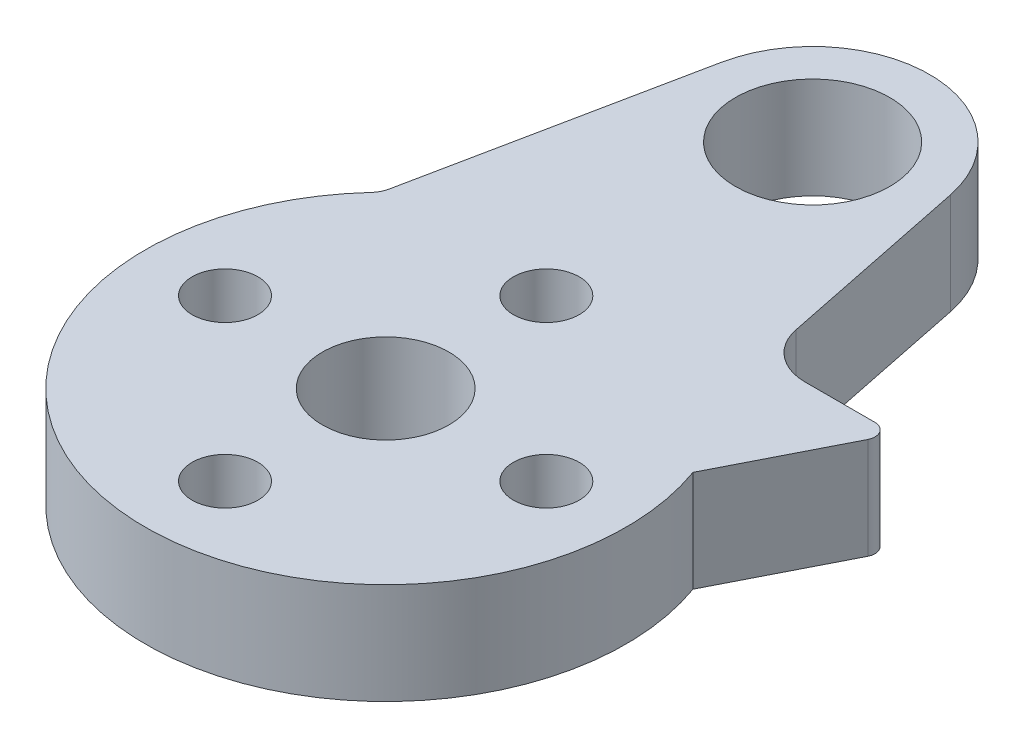
ISO-10303-21;
HEADER;
FILE_DESCRIPTION(('STEP AP214'),'2;1');
FILE_NAME('part.step','',(''),(''),'','','');
FILE_SCHEMA(('AUTOMOTIVE_DESIGN { 1 0 10303 214 1 1 1 1 }'));
ENDSEC;
DATA;
#1=APPLICATION_CONTEXT('core data for automotive mechanical design processes');
#2=APPLICATION_PROTOCOL_DEFINITION('international standard','automotive_design',2000,#1);
#3=PRODUCT_CONTEXT('',#1,'mechanical');
#4=PRODUCT('Part','Part','',(#3));
#5=PRODUCT_RELATED_PRODUCT_CATEGORY('part','',(#4));
#6=PRODUCT_DEFINITION_FORMATION('','',#4);
#7=PRODUCT_DEFINITION_CONTEXT('part definition',#1,'design');
#8=PRODUCT_DEFINITION('design','',#6,#7);
#9=PRODUCT_DEFINITION_SHAPE('','',#8);
#10=(LENGTH_UNIT() NAMED_UNIT(*) SI_UNIT(.MILLI.,.METRE.));
#11=(NAMED_UNIT(*) PLANE_ANGLE_UNIT() SI_UNIT($,.RADIAN.));
#12=(NAMED_UNIT(*) SI_UNIT($,.STERADIAN.) SOLID_ANGLE_UNIT());
#13=UNCERTAINTY_MEASURE_WITH_UNIT(LENGTH_MEASURE(1.E-05),#10,'distance_accuracy_value','');
#14=(GEOMETRIC_REPRESENTATION_CONTEXT(3) GLOBAL_UNCERTAINTY_ASSIGNED_CONTEXT((#13)) GLOBAL_UNIT_ASSIGNED_CONTEXT((#10,
#11,#12)) REPRESENTATION_CONTEXT('',''));
#15=CARTESIAN_POINT('',(0.,0.,0.));
#16=DIRECTION('',(0.,0.,1.));
#17=DIRECTION('',(1.,0.,0.));
#18=AXIS2_PLACEMENT_3D('',#15,#16,#17);
#19=CARTESIAN_POINT('',(0.,4.,-16.87456));
#20=DIRECTION('',(0.,1.,0.));
#21=DIRECTION('',(0.,0.,1.));
#22=AXIS2_PLACEMENT_3D('',#19,#20,#21);
#23=PLANE('',#22);
#24=CARTESIAN_POINT('',(0.,4.,0.));
#25=DIRECTION('',(0.,1.,0.));
#26=DIRECTION('',(0.,0.,1.));
#27=AXIS2_PLACEMENT_3D('',#24,#25,#26);
#28=CIRCLE('',#27,2.5);
#29=CARTESIAN_POINT('',(0.,4.,2.5));
#30=VERTEX_POINT('',#29);
#31=EDGE_CURVE('E206',#30,#30,#28,.T.);
#32=ORIENTED_EDGE('',*,*,#31,.F.);
#33=EDGE_LOOP('',(#32));
#34=FACE_BOUND('',#33,.T.);
#35=DIRECTION('',(0.453214391492151,0.,-0.891401545513804));
#36=VECTOR('',#35,1.);
#37=CARTESIAN_POINT('',(10.3610608647952,4.,-5.99037571853454));
#38=LINE('',#37,#36);
#39=CARTESIAN_POINT('',(8.94380715769553,4.,-3.20286021017999));
#40=VERTEX_POINT('',#39);
#41=CARTESIAN_POINT('',(11.2728766794748,4.,-7.78377425504894));
#42=VERTEX_POINT('',#41);
#43=EDGE_CURVE('E168',#40,#42,#38,.T.);
#44=ORIENTED_EDGE('',*,*,#43,.T.);
#45=CARTESIAN_POINT('',(10.8271759067179,4.,-8.01038145079501));
#46=DIRECTION('',(0.,1.,0.));
#47=DIRECTION('',(0.,0.,1.));
#48=AXIS2_PLACEMENT_3D('',#45,#46,#47);
#49=CIRCLE('',#48,0.5);
#50=CARTESIAN_POINT('',(10.8271759067179,4.,-8.51038145079501));
#51=VERTEX_POINT('',#50);
#52=EDGE_CURVE('E147',#42,#51,#49,.T.);
#53=ORIENTED_EDGE('',*,*,#52,.T.);
#54=DIRECTION('',(-1.,0.,0.));
#55=VECTOR('',#54,1.);
#56=CARTESIAN_POINT('',(10.3923048454133,4.,-8.51038145079501));
#57=LINE('',#56,#55);
#58=CARTESIAN_POINT('',(8.06078463189149,4.,-8.51038145079501));
#59=VERTEX_POINT('',#58);
#60=EDGE_CURVE('E162',#51,#59,#57,.T.);
#61=ORIENTED_EDGE('',*,*,#60,.T.);
#62=CARTESIAN_POINT('',(8.06078463189149,4.,-10.510381450795));
#63=DIRECTION('',(0.,1.,0.));
#64=DIRECTION('',(0.,0.,1.));
#65=AXIS2_PLACEMENT_3D('',#62,#63,#64);
#66=CIRCLE('',#65,2.);
#67=CARTESIAN_POINT('',(6.10119283766495,4.,-10.110381450795));
#68=VERTEX_POINT('',#67);
#69=EDGE_CURVE('E47',#59,#68,#66,.F.);
#70=ORIENTED_EDGE('',*,*,#69,.T.);
#71=DIRECTION('',(-0.2,0.,-0.979795897113271));
#72=VECTOR('',#71,1.);
#73=CARTESIAN_POINT('',(4.53164224618782,4.,-17.7995776));
#74=LINE('',#73,#72);
#75=CARTESIAN_POINT('',(4.53164224618782,4.,-17.7995776));
#76=VERTEX_POINT('',#75);
#77=EDGE_CURVE('E118',#68,#76,#74,.T.);
#78=ORIENTED_EDGE('',*,*,#77,.T.);
#79=CARTESIAN_POINT('',(0.,4.,-16.87456));
#80=DIRECTION('',(0.,1.,0.));
#81=DIRECTION('',(0.,0.,1.));
#82=AXIS2_PLACEMENT_3D('',#79,#80,#81);
#83=CIRCLE('',#82,4.625088);
#84=CARTESIAN_POINT('',(-4.53164224618782,4.,-17.7995776));
#85=VERTEX_POINT('',#84);
#86=EDGE_CURVE('E119',#76,#85,#83,.T.);
#87=ORIENTED_EDGE('',*,*,#86,.T.);
#88=DIRECTION('',(-0.2,0.,0.979795897113271));
#89=VECTOR('',#88,1.);
#90=CARTESIAN_POINT('',(-4.53164224618782,4.,-17.7995776));
#91=LINE('',#90,#89);
#92=CARTESIAN_POINT('',(-6.75670179426697,4.,-6.8990565197967));
#93=VERTEX_POINT('',#92);
#94=EDGE_CURVE('E109',#85,#93,#91,.T.);
#95=ORIENTED_EDGE('',*,*,#94,.T.);
#96=CARTESIAN_POINT('',(-7.73649769138025,4.,-7.09905651979671));
#97=DIRECTION('',(0.,1.,0.));
#98=DIRECTION('',(0.,0.,1.));
#99=AXIS2_PLACEMENT_3D('',#96,#97,#98);
#100=CIRCLE('',#99,1.);
#101=CARTESIAN_POINT('',(-6.99968838743927,4.,-6.42295589886369));
#102=VERTEX_POINT('',#101);
#103=EDGE_CURVE('E140',#93,#102,#100,.F.);
#104=ORIENTED_EDGE('',*,*,#103,.T.);
#105=CARTESIAN_POINT('',(0.,4.,0.));
#106=DIRECTION('',(0.,1.,0.));
#107=DIRECTION('',(0.,0.,1.));
#108=AXIS2_PLACEMENT_3D('',#105,#106,#107);
#109=CIRCLE('',#108,9.5);
#110=EDGE_CURVE('E180',#102,#40,#109,.T.);
#111=ORIENTED_EDGE('',*,*,#110,.T.);
#112=EDGE_LOOP('',(#44,#53,#61,#70,#78,#87,#95,#104,#111));
#113=FACE_BOUND('',#112,.T.);
#114=CARTESIAN_POINT('',(0.,4.,-6.35));
#115=DIRECTION('',(0.,1.,0.));
#116=DIRECTION('',(0.,0.,1.));
#117=AXIS2_PLACEMENT_3D('',#114,#115,#116);
#118=CIRCLE('',#117,1.3);
#119=CARTESIAN_POINT('',(0.,4.,-5.05));
#120=VERTEX_POINT('',#119);
#121=EDGE_CURVE('E186',#120,#120,#118,.T.);
#122=ORIENTED_EDGE('',*,*,#121,.F.);
#123=EDGE_LOOP('',(#122));
#124=FACE_BOUND('',#123,.T.);
#125=CARTESIAN_POINT('',(6.35000000000018,4.,-1.79311378806878E-13));
#126=DIRECTION('',(0.,1.,0.));
#127=DIRECTION('',(0.,0.,1.));
#128=AXIS2_PLACEMENT_3D('',#125,#126,#127);
#129=CIRCLE('',#128,1.30000000000014);
#130=CARTESIAN_POINT('',(6.35000000000018,4.,1.29999999999996));
#131=VERTEX_POINT('',#130);
#132=EDGE_CURVE('E192',#131,#131,#129,.T.);
#133=ORIENTED_EDGE('',*,*,#132,.F.);
#134=EDGE_LOOP('',(#133));
#135=FACE_BOUND('',#134,.T.);
#136=CARTESIAN_POINT('',(3.58622757613755E-13,4.,6.35));
#137=DIRECTION('',(0.,1.,0.));
#138=DIRECTION('',(0.,0.,1.));
#139=AXIS2_PLACEMENT_3D('',#136,#137,#138);
#140=CIRCLE('',#139,1.30000000000039);
#141=CARTESIAN_POINT('',(3.58622757613755E-13,4.,7.65000000000039));
#142=VERTEX_POINT('',#141);
#143=EDGE_CURVE('E198',#142,#142,#140,.T.);
#144=ORIENTED_EDGE('',*,*,#143,.F.);
#145=EDGE_LOOP('',(#144));
#146=FACE_BOUND('',#145,.T.);
#147=CARTESIAN_POINT('',(-6.34999999999982,4.,1.80089029524336E-13));
#148=DIRECTION('',(0.,1.,0.));
#149=DIRECTION('',(0.,0.,1.));
#150=AXIS2_PLACEMENT_3D('',#147,#148,#149);
#151=CIRCLE('',#150,1.30000000000029);
#152=CARTESIAN_POINT('',(-6.34999999999982,4.,1.30000000000047));
#153=VERTEX_POINT('',#152);
#154=EDGE_CURVE('E179',#153,#153,#151,.T.);
#155=ORIENTED_EDGE('',*,*,#154,.F.);
#156=EDGE_LOOP('',(#155));
#157=FACE_BOUND('',#156,.T.);
#158=CARTESIAN_POINT('',(0.,4.,-16.87456));
#159=DIRECTION('',(0.,1.,0.));
#160=DIRECTION('',(0.,0.,1.));
#161=AXIS2_PLACEMENT_3D('',#158,#159,#160);
#162=CIRCLE('',#161,3.05);
#163=CARTESIAN_POINT('',(0.,4.,-13.82456));
#164=VERTEX_POINT('',#163);
#165=EDGE_CURVE('E212',#164,#164,#162,.T.);
#166=ORIENTED_EDGE('',*,*,#165,.F.);
#167=EDGE_LOOP('',(#166));
#168=FACE_BOUND('',#167,.T.);
#169=ADVANCED_FACE('F39',(#34,#113,#124,#135,#146,#157,#168),#23,.T.);
#170=CARTESIAN_POINT('',(0.,0.,-16.87456));
#171=DIRECTION('',(0.,1.,0.));
#172=DIRECTION('',(0.,0.,1.));
#173=AXIS2_PLACEMENT_3D('',#170,#171,#172);
#174=PLANE('',#173);
#175=CARTESIAN_POINT('',(0.,0.,0.));
#176=DIRECTION('',(0.,1.,0.));
#177=DIRECTION('',(0.,0.,1.));
#178=AXIS2_PLACEMENT_3D('',#175,#176,#177);
#179=CIRCLE('',#178,2.5);
#180=CARTESIAN_POINT('',(0.,0.,2.5));
#181=VERTEX_POINT('',#180);
#182=EDGE_CURVE('E185',#181,#181,#179,.T.);
#183=ORIENTED_EDGE('',*,*,#182,.T.);
#184=EDGE_LOOP('',(#183));
#185=FACE_BOUND('',#184,.T.);
#186=DIRECTION('',(-0.2,0.,-0.979795897113271));
#187=VECTOR('',#186,1.);
#188=CARTESIAN_POINT('',(4.53164224618782,0.,-17.7995776));
#189=LINE('',#188,#187);
#190=CARTESIAN_POINT('',(6.10119283766495,0.,-10.110381450795));
#191=VERTEX_POINT('',#190);
#192=CARTESIAN_POINT('',(4.53164224618782,0.,-17.7995776));
#193=VERTEX_POINT('',#192);
#194=EDGE_CURVE('E127',#191,#193,#189,.T.);
#195=ORIENTED_EDGE('',*,*,#194,.F.);
#196=CARTESIAN_POINT('',(8.06078463189149,0.,-10.510381450795));
#197=DIRECTION('',(0.,1.,0.));
#198=DIRECTION('',(0.,0.,1.));
#199=AXIS2_PLACEMENT_3D('',#196,#197,#198);
#200=CIRCLE('',#199,2.);
#201=CARTESIAN_POINT('',(8.06078463189149,0.,-8.51038145079501));
#202=VERTEX_POINT('',#201);
#203=EDGE_CURVE('E11',#191,#202,#200,.T.);
#204=ORIENTED_EDGE('',*,*,#203,.T.);
#205=DIRECTION('',(1.,0.,0.));
#206=VECTOR('',#205,1.);
#207=CARTESIAN_POINT('',(10.3923048454133,0.,-8.51038145079501));
#208=LINE('',#207,#206);
#209=CARTESIAN_POINT('',(10.8271759067179,0.,-8.51038145079501));
#210=VERTEX_POINT('',#209);
#211=EDGE_CURVE('E164',#202,#210,#208,.T.);
#212=ORIENTED_EDGE('',*,*,#211,.T.);
#213=CARTESIAN_POINT('',(10.8271759067179,0.,-8.01038145079501));
#214=DIRECTION('',(0.,1.,0.));
#215=DIRECTION('',(0.,0.,1.));
#216=AXIS2_PLACEMENT_3D('',#213,#214,#215);
#217=CIRCLE('',#216,0.5);
#218=CARTESIAN_POINT('',(11.2728766794748,0.,-7.78377425504894));
#219=VERTEX_POINT('',#218);
#220=EDGE_CURVE('E152',#210,#219,#217,.F.);
#221=ORIENTED_EDGE('',*,*,#220,.T.);
#222=DIRECTION('',(-0.453214391492151,0.,0.891401545513804));
#223=VECTOR('',#222,1.);
#224=CARTESIAN_POINT('',(10.3610608647952,0.,-5.99037571853454));
#225=LINE('',#224,#223);
#226=CARTESIAN_POINT('',(8.94380715769553,0.,-3.20286021017999));
#227=VERTEX_POINT('',#226);
#228=EDGE_CURVE('E171',#219,#227,#225,.T.);
#229=ORIENTED_EDGE('',*,*,#228,.T.);
#230=CARTESIAN_POINT('',(0.,0.,0.));
#231=DIRECTION('',(0.,1.,0.));
#232=DIRECTION('',(0.,0.,1.));
#233=AXIS2_PLACEMENT_3D('',#230,#231,#232);
#234=CIRCLE('',#233,9.5);
#235=CARTESIAN_POINT('',(-6.99968838743927,0.,-6.42295589886369));
#236=VERTEX_POINT('',#235);
#237=EDGE_CURVE('E176',#236,#227,#234,.T.);
#238=ORIENTED_EDGE('',*,*,#237,.F.);
#239=CARTESIAN_POINT('',(-7.73649769138025,0.,-7.09905651979671));
#240=DIRECTION('',(0.,1.,0.));
#241=DIRECTION('',(0.,0.,1.));
#242=AXIS2_PLACEMENT_3D('',#239,#240,#241);
#243=CIRCLE('',#242,1.);
#244=CARTESIAN_POINT('',(-6.75670179426697,0.,-6.8990565197967));
#245=VERTEX_POINT('',#244);
#246=EDGE_CURVE('E142',#236,#245,#243,.T.);
#247=ORIENTED_EDGE('',*,*,#246,.T.);
#248=DIRECTION('',(-0.2,0.,0.979795897113271));
#249=VECTOR('',#248,1.);
#250=CARTESIAN_POINT('',(-4.53164224618782,0.,-17.7995776));
#251=LINE('',#250,#249);
#252=CARTESIAN_POINT('',(-4.53164224618782,0.,-17.7995776));
#253=VERTEX_POINT('',#252);
#254=EDGE_CURVE('E219',#253,#245,#251,.T.);
#255=ORIENTED_EDGE('',*,*,#254,.F.);
#256=CARTESIAN_POINT('',(0.,0.,-16.87456));
#257=DIRECTION('',(0.,1.,0.));
#258=DIRECTION('',(0.,0.,1.));
#259=AXIS2_PLACEMENT_3D('',#256,#257,#258);
#260=CIRCLE('',#259,4.625088);
#261=EDGE_CURVE('E131',#193,#253,#260,.T.);
#262=ORIENTED_EDGE('',*,*,#261,.F.);
#263=EDGE_LOOP('',(#195,#204,#212,#221,#229,#238,#247,#255,#262));
#264=FACE_BOUND('',#263,.T.);
#265=CARTESIAN_POINT('',(0.,0.,-6.35));
#266=DIRECTION('',(0.,1.,0.));
#267=DIRECTION('',(0.,0.,1.));
#268=AXIS2_PLACEMENT_3D('',#265,#266,#267);
#269=CIRCLE('',#268,1.3);
#270=CARTESIAN_POINT('',(0.,0.,-5.05));
#271=VERTEX_POINT('',#270);
#272=EDGE_CURVE('E182',#271,#271,#269,.T.);
#273=ORIENTED_EDGE('',*,*,#272,.T.);
#274=EDGE_LOOP('',(#273));
#275=FACE_BOUND('',#274,.T.);
#276=CARTESIAN_POINT('',(6.35000000000018,0.,-1.79311378806878E-13));
#277=DIRECTION('',(0.,1.,0.));
#278=DIRECTION('',(0.,0.,1.));
#279=AXIS2_PLACEMENT_3D('',#276,#277,#278);
#280=CIRCLE('',#279,1.30000000000014);
#281=CARTESIAN_POINT('',(6.35000000000018,0.,1.29999999999996));
#282=VERTEX_POINT('',#281);
#283=EDGE_CURVE('E189',#282,#282,#280,.T.);
#284=ORIENTED_EDGE('',*,*,#283,.T.);
#285=EDGE_LOOP('',(#284));
#286=FACE_BOUND('',#285,.T.);
#287=CARTESIAN_POINT('',(3.58622757613755E-13,0.,6.35));
#288=DIRECTION('',(0.,1.,0.));
#289=DIRECTION('',(0.,0.,1.));
#290=AXIS2_PLACEMENT_3D('',#287,#288,#289);
#291=CIRCLE('',#290,1.30000000000039);
#292=CARTESIAN_POINT('',(3.58622757613755E-13,0.,7.65000000000039));
#293=VERTEX_POINT('',#292);
#294=EDGE_CURVE('E195',#293,#293,#291,.T.);
#295=ORIENTED_EDGE('',*,*,#294,.T.);
#296=EDGE_LOOP('',(#295));
#297=FACE_BOUND('',#296,.T.);
#298=CARTESIAN_POINT('',(-6.34999999999982,0.,1.80089029524336E-13));
#299=DIRECTION('',(0.,1.,0.));
#300=DIRECTION('',(0.,0.,1.));
#301=AXIS2_PLACEMENT_3D('',#298,#299,#300);
#302=CIRCLE('',#301,1.30000000000029);
#303=CARTESIAN_POINT('',(-6.34999999999982,0.,1.30000000000047));
#304=VERTEX_POINT('',#303);
#305=EDGE_CURVE('E201',#304,#304,#302,.T.);
#306=ORIENTED_EDGE('',*,*,#305,.T.);
#307=EDGE_LOOP('',(#306));
#308=FACE_BOUND('',#307,.T.);
#309=CARTESIAN_POINT('',(0.,0.,-16.87456));
#310=DIRECTION('',(0.,1.,0.));
#311=DIRECTION('',(0.,0.,1.));
#312=AXIS2_PLACEMENT_3D('',#309,#310,#311);
#313=CIRCLE('',#312,3.05);
#314=CARTESIAN_POINT('',(0.,0.,-13.82456));
#315=VERTEX_POINT('',#314);
#316=EDGE_CURVE('E209',#315,#315,#313,.T.);
#317=ORIENTED_EDGE('',*,*,#316,.T.);
#318=EDGE_LOOP('',(#317));
#319=FACE_BOUND('',#318,.T.);
#320=ADVANCED_FACE('F222',(#185,#264,#275,#286,#297,#308,#319),#174,.F.);
#321=CARTESIAN_POINT('',(0.,4.,-16.87456));
#322=DIRECTION('',(0.,-1.,0.));
#323=DIRECTION('',(0.,0.,-1.));
#324=AXIS2_PLACEMENT_3D('',#321,#322,#323);
#325=CYLINDRICAL_SURFACE('',#324,4.625088);
#326=ORIENTED_EDGE('',*,*,#261,.T.);
#327=DIRECTION('',(0.,-1.,0.));
#328=VECTOR('',#327,1.);
#329=CARTESIAN_POINT('',(-4.53164224618782,4.,-17.7995776));
#330=LINE('',#329,#328);
#331=EDGE_CURVE('E114',#85,#253,#330,.T.);
#332=ORIENTED_EDGE('',*,*,#331,.F.);
#333=ORIENTED_EDGE('',*,*,#86,.F.);
#334=DIRECTION('',(0.,-1.,0.));
#335=VECTOR('',#334,1.);
#336=CARTESIAN_POINT('',(4.53164224618782,4.,-17.7995776));
#337=LINE('',#336,#335);
#338=EDGE_CURVE('E132',#76,#193,#337,.T.);
#339=ORIENTED_EDGE('',*,*,#338,.T.);
#340=EDGE_LOOP('',(#326,#332,#333,#339));
#341=FACE_BOUND('',#340,.T.);
#342=ADVANCED_FACE('F129',(#341),#325,.T.);
#343=CARTESIAN_POINT('',(-4.53164224618782,4.,-17.7995776));
#344=DIRECTION('',(0.979795897113271,0.,0.2));
#345=DIRECTION('',(0.2,0.,-0.979795897113271));
#346=AXIS2_PLACEMENT_3D('',#343,#344,#345);
#347=PLANE('',#346);
#348=ORIENTED_EDGE('',*,*,#254,.T.);
#349=DIRECTION('',(0.,1.,0.));
#350=VECTOR('',#349,1.);
#351=CARTESIAN_POINT('',(-6.75670179426697,4.,-6.89905651979671));
#352=LINE('',#351,#350);
#353=EDGE_CURVE('E117',#245,#93,#352,.T.);
#354=ORIENTED_EDGE('',*,*,#353,.T.);
#355=ORIENTED_EDGE('',*,*,#94,.F.);
#356=ORIENTED_EDGE('',*,*,#331,.T.);
#357=EDGE_LOOP('',(#348,#354,#355,#356));
#358=FACE_BOUND('',#357,.T.);
#359=ADVANCED_FACE('F112',(#358),#347,.F.);
#360=CARTESIAN_POINT('',(4.53164224618782,4.,-17.7995776));
#361=DIRECTION('',(-0.979795897113271,0.,0.2));
#362=DIRECTION('',(0.2,0.,0.979795897113271));
#363=AXIS2_PLACEMENT_3D('',#360,#361,#362);
#364=PLANE('',#363);
#365=ORIENTED_EDGE('',*,*,#77,.F.);
#366=DIRECTION('',(0.,1.,0.));
#367=VECTOR('',#366,1.);
#368=CARTESIAN_POINT('',(6.10119283766495,4.,-10.110381450795));
#369=LINE('',#368,#367);
#370=EDGE_CURVE('E54',#68,#191,#369,.F.);
#371=ORIENTED_EDGE('',*,*,#370,.T.);
#372=ORIENTED_EDGE('',*,*,#194,.T.);
#373=ORIENTED_EDGE('',*,*,#338,.F.);
#374=EDGE_LOOP('',(#365,#371,#372,#373));
#375=FACE_BOUND('',#374,.T.);
#376=ADVANCED_FACE('F220',(#375),#364,.F.);
#377=CARTESIAN_POINT('',(0.,4.,-16.87456));
#378=DIRECTION('',(0.,-1.,0.));
#379=DIRECTION('',(0.,0.,-1.));
#380=AXIS2_PLACEMENT_3D('',#377,#378,#379);
#381=CYLINDRICAL_SURFACE('',#380,3.05);
#382=ORIENTED_EDGE('',*,*,#165,.T.);
#383=EDGE_LOOP('',(#382));
#384=FACE_BOUND('',#383,.T.);
#385=ORIENTED_EDGE('',*,*,#316,.F.);
#386=EDGE_LOOP('',(#385));
#387=FACE_BOUND('',#386,.T.);
#388=ADVANCED_FACE('F256',(#384,#387),#381,.F.);
#389=CARTESIAN_POINT('',(0.,4.,0.));
#390=DIRECTION('',(0.,-1.,0.));
#391=DIRECTION('',(0.,0.,-1.));
#392=AXIS2_PLACEMENT_3D('',#389,#390,#391);
#393=CYLINDRICAL_SURFACE('',#392,2.5);
#394=ORIENTED_EDGE('',*,*,#182,.F.);
#395=EDGE_LOOP('',(#394));
#396=FACE_BOUND('',#395,.T.);
#397=ORIENTED_EDGE('',*,*,#31,.T.);
#398=EDGE_LOOP('',(#397));
#399=FACE_BOUND('',#398,.T.);
#400=ADVANCED_FACE('F291',(#396,#399),#393,.F.);
#401=CARTESIAN_POINT('',(-6.34999999999982,0.,1.80089029524336E-13));
#402=DIRECTION('',(0.,1.,0.));
#403=DIRECTION('',(0.,0.,1.));
#404=AXIS2_PLACEMENT_3D('',#401,#402,#403);
#405=CYLINDRICAL_SURFACE('',#404,1.30000000000029);
#406=ORIENTED_EDGE('',*,*,#305,.F.);
#407=EDGE_LOOP('',(#406));
#408=FACE_BOUND('',#407,.T.);
#409=ORIENTED_EDGE('',*,*,#154,.T.);
#410=EDGE_LOOP('',(#409));
#411=FACE_BOUND('',#410,.T.);
#412=ADVANCED_FACE('F288',(#408,#411),#405,.F.);
#413=CARTESIAN_POINT('',(3.58622757613755E-13,0.,6.35));
#414=DIRECTION('',(0.,1.,0.));
#415=DIRECTION('',(0.,0.,1.));
#416=AXIS2_PLACEMENT_3D('',#413,#414,#415);
#417=CYLINDRICAL_SURFACE('',#416,1.30000000000039);
#418=ORIENTED_EDGE('',*,*,#294,.F.);
#419=EDGE_LOOP('',(#418));
#420=FACE_BOUND('',#419,.T.);
#421=ORIENTED_EDGE('',*,*,#143,.T.);
#422=EDGE_LOOP('',(#421));
#423=FACE_BOUND('',#422,.T.);
#424=ADVANCED_FACE('F284',(#420,#423),#417,.F.);
#425=CARTESIAN_POINT('',(6.35000000000018,0.,-1.79311378806878E-13));
#426=DIRECTION('',(0.,1.,0.));
#427=DIRECTION('',(0.,0.,1.));
#428=AXIS2_PLACEMENT_3D('',#425,#426,#427);
#429=CYLINDRICAL_SURFACE('',#428,1.30000000000014);
#430=ORIENTED_EDGE('',*,*,#283,.F.);
#431=EDGE_LOOP('',(#430));
#432=FACE_BOUND('',#431,.T.);
#433=ORIENTED_EDGE('',*,*,#132,.T.);
#434=EDGE_LOOP('',(#433));
#435=FACE_BOUND('',#434,.T.);
#436=ADVANCED_FACE('F280',(#432,#435),#429,.F.);
#437=CARTESIAN_POINT('',(0.,0.,-6.35));
#438=DIRECTION('',(0.,1.,0.));
#439=DIRECTION('',(0.,0.,1.));
#440=AXIS2_PLACEMENT_3D('',#437,#438,#439);
#441=CYLINDRICAL_SURFACE('',#440,1.3);
#442=ORIENTED_EDGE('',*,*,#272,.F.);
#443=EDGE_LOOP('',(#442));
#444=FACE_BOUND('',#443,.T.);
#445=ORIENTED_EDGE('',*,*,#121,.T.);
#446=EDGE_LOOP('',(#445));
#447=FACE_BOUND('',#446,.T.);
#448=ADVANCED_FACE('F277',(#444,#447),#441,.F.);
#449=CARTESIAN_POINT('',(0.,0.,0.));
#450=DIRECTION('',(0.,1.,0.));
#451=DIRECTION('',(0.,0.,1.));
#452=AXIS2_PLACEMENT_3D('',#449,#450,#451);
#453=CYLINDRICAL_SURFACE('',#452,9.5);
#454=ORIENTED_EDGE('',*,*,#110,.F.);
#455=DIRECTION('',(0.,1.,0.));
#456=VECTOR('',#455,1.);
#457=CARTESIAN_POINT('',(-6.99968838743927,0.,-6.42295589886369));
#458=LINE('',#457,#456);
#459=EDGE_CURVE('E134',#102,#236,#458,.F.);
#460=ORIENTED_EDGE('',*,*,#459,.T.);
#461=ORIENTED_EDGE('',*,*,#237,.T.);
#462=DIRECTION('',(0.,1.,0.));
#463=VECTOR('',#462,1.);
#464=CARTESIAN_POINT('',(8.94380715769553,-12.2360342524986,-3.20286021017999));
#465=LINE('',#464,#463);
#466=EDGE_CURVE('E167',#227,#40,#465,.T.);
#467=ORIENTED_EDGE('',*,*,#466,.T.);
#468=EDGE_LOOP('',(#454,#460,#461,#467));
#469=FACE_BOUND('',#468,.T.);
#470=ADVANCED_FACE('F231',(#469),#453,.T.);
#471=CARTESIAN_POINT('',(10.3923048454133,-12.2360342524986,-8.51038145079501));
#472=DIRECTION('',(0.,0.,-1.));
#473=DIRECTION('',(-1.,0.,0.));
#474=AXIS2_PLACEMENT_3D('',#471,#472,#473);
#475=PLANE('',#474);
#476=ORIENTED_EDGE('',*,*,#211,.F.);
#477=DIRECTION('',(0.,1.,0.));
#478=VECTOR('',#477,1.);
#479=CARTESIAN_POINT('',(8.06078463189149,-12.2360342524986,-8.51038145079501));
#480=LINE('',#479,#478);
#481=EDGE_CURVE('E154',#202,#59,#480,.T.);
#482=ORIENTED_EDGE('',*,*,#481,.T.);
#483=ORIENTED_EDGE('',*,*,#60,.F.);
#484=DIRECTION('',(0.,1.,0.));
#485=VECTOR('',#484,1.);
#486=CARTESIAN_POINT('',(10.8271759067179,-12.2360342524986,-8.51038145079501));
#487=LINE('',#486,#485);
#488=EDGE_CURVE('E149',#51,#210,#487,.F.);
#489=ORIENTED_EDGE('',*,*,#488,.T.);
#490=EDGE_LOOP('',(#476,#482,#483,#489));
#491=FACE_BOUND('',#490,.T.);
#492=ADVANCED_FACE('F161',(#491),#475,.T.);
#493=CARTESIAN_POINT('',(10.3610608647952,-12.2360342524986,-5.99037571853454));
#494=DIRECTION('',(0.891401545513804,0.,0.453214391492151));
#495=DIRECTION('',(0.453214391492151,0.,-0.891401545513804));
#496=AXIS2_PLACEMENT_3D('',#493,#494,#495);
#497=PLANE('',#496);
#498=ORIENTED_EDGE('',*,*,#228,.F.);
#499=DIRECTION('',(0.,1.,0.));
#500=VECTOR('',#499,1.);
#501=CARTESIAN_POINT('',(11.2728766794748,-12.2360342524986,-7.78377425504894));
#502=LINE('',#501,#500);
#503=EDGE_CURVE('E144',#219,#42,#502,.T.);
#504=ORIENTED_EDGE('',*,*,#503,.T.);
#505=ORIENTED_EDGE('',*,*,#43,.F.);
#506=ORIENTED_EDGE('',*,*,#466,.F.);
#507=EDGE_LOOP('',(#498,#504,#505,#506));
#508=FACE_BOUND('',#507,.T.);
#509=ADVANCED_FACE('F236',(#508),#497,.T.);
#510=CARTESIAN_POINT('',(-7.73649769138025,0.,-7.09905651979671));
#511=DIRECTION('',(0.,1.,0.));
#512=DIRECTION('',(0.,0.,1.));
#513=AXIS2_PLACEMENT_3D('',#510,#511,#512);
#514=CYLINDRICAL_SURFACE('',#513,1.);
#515=ORIENTED_EDGE('',*,*,#246,.F.);
#516=ORIENTED_EDGE('',*,*,#459,.F.);
#517=ORIENTED_EDGE('',*,*,#103,.F.);
#518=ORIENTED_EDGE('',*,*,#353,.F.);
#519=EDGE_LOOP('',(#515,#516,#517,#518));
#520=FACE_BOUND('',#519,.T.);
#521=ADVANCED_FACE('F227',(#520),#514,.F.);
#522=CARTESIAN_POINT('',(10.8271759067179,-12.2360342524986,-8.01038145079501));
#523=DIRECTION('',(0.,1.,0.));
#524=DIRECTION('',(0.,0.,1.));
#525=AXIS2_PLACEMENT_3D('',#522,#523,#524);
#526=CYLINDRICAL_SURFACE('',#525,0.5);
#527=ORIENTED_EDGE('',*,*,#220,.F.);
#528=ORIENTED_EDGE('',*,*,#488,.F.);
#529=ORIENTED_EDGE('',*,*,#52,.F.);
#530=ORIENTED_EDGE('',*,*,#503,.F.);
#531=EDGE_LOOP('',(#527,#528,#529,#530));
#532=FACE_BOUND('',#531,.T.);
#533=ADVANCED_FACE('F240',(#532),#526,.T.);
#534=CARTESIAN_POINT('',(8.06078463189149,-12.2360342524986,-10.510381450795));
#535=DIRECTION('',(0.,1.,0.));
#536=DIRECTION('',(0.,0.,1.));
#537=AXIS2_PLACEMENT_3D('',#534,#535,#536);
#538=CYLINDRICAL_SURFACE('',#537,2.);
#539=ORIENTED_EDGE('',*,*,#203,.F.);
#540=ORIENTED_EDGE('',*,*,#370,.F.);
#541=ORIENTED_EDGE('',*,*,#69,.F.);
#542=ORIENTED_EDGE('',*,*,#481,.F.);
#543=EDGE_LOOP('',(#539,#540,#541,#542));
#544=FACE_BOUND('',#543,.T.);
#545=ADVANCED_FACE('F41',(#544),#538,.F.);
#546=CLOSED_SHELL('',(#169,#320,#342,#359,#376,#388,#400,#412,#424,#436,#448,#470,#492,#509,
#521,#533,#545));
#547=MANIFOLD_SOLID_BREP('B2',#546);
#548=ADVANCED_BREP_SHAPE_REPRESENTATION('',(#18,#547),#14);
#549=SHAPE_DEFINITION_REPRESENTATION(#9,#548);
ENDSEC;
END-ISO-10303-21;
